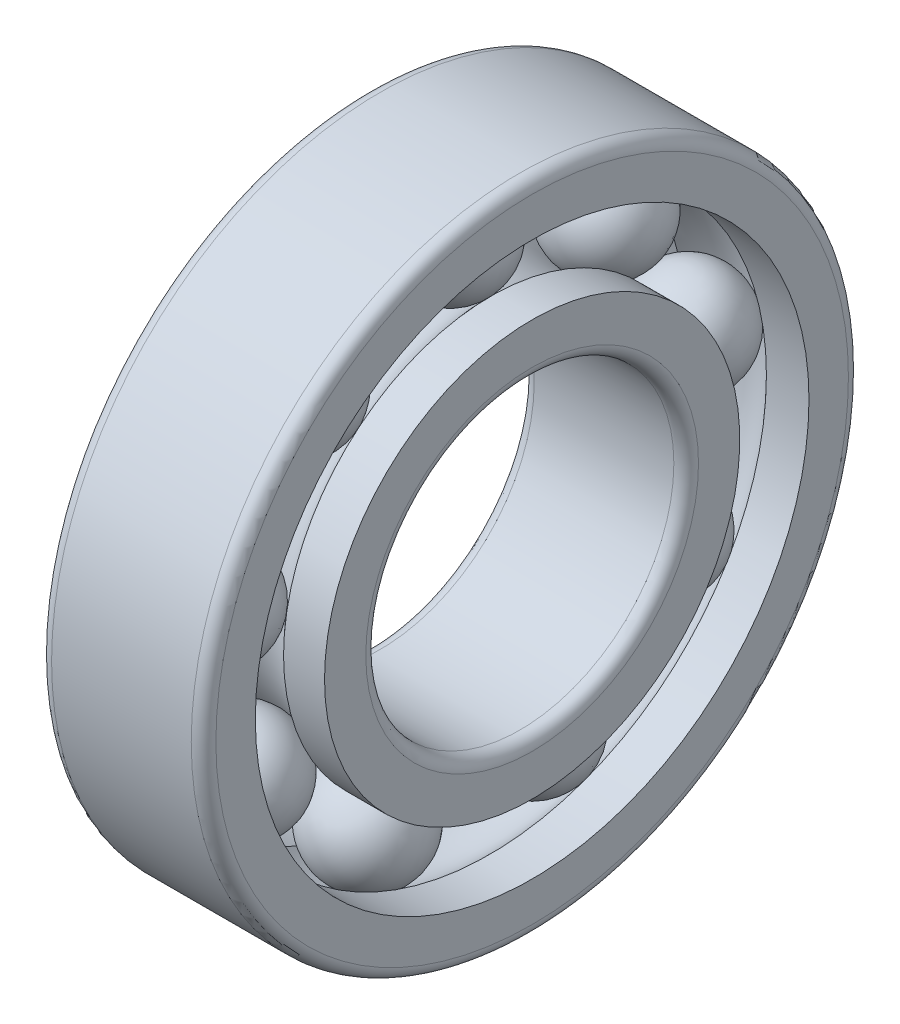
ISO-10303-21;
HEADER;
FILE_DESCRIPTION(('STEP AP214'),'2;1');
FILE_NAME('part.step','',(''),(''),'','','');
FILE_SCHEMA(('AUTOMOTIVE_DESIGN { 1 0 10303 214 1 1 1 1 }'));
ENDSEC;
DATA;
#1=APPLICATION_CONTEXT('core data for automotive mechanical design processes');
#2=APPLICATION_PROTOCOL_DEFINITION('international standard','automotive_design',2000,#1);
#3=PRODUCT_CONTEXT('',#1,'mechanical');
#4=PRODUCT('Part','Part','',(#3));
#5=PRODUCT_RELATED_PRODUCT_CATEGORY('part','',(#4));
#6=PRODUCT_DEFINITION_FORMATION('','',#4);
#7=PRODUCT_DEFINITION_CONTEXT('part definition',#1,'design');
#8=PRODUCT_DEFINITION('design','',#6,#7);
#9=PRODUCT_DEFINITION_SHAPE('','',#8);
#10=(LENGTH_UNIT() NAMED_UNIT(*) SI_UNIT(.MILLI.,.METRE.));
#11=(NAMED_UNIT(*) PLANE_ANGLE_UNIT() SI_UNIT($,.RADIAN.));
#12=(NAMED_UNIT(*) SI_UNIT($,.STERADIAN.) SOLID_ANGLE_UNIT());
#13=UNCERTAINTY_MEASURE_WITH_UNIT(LENGTH_MEASURE(1.E-05),#10,'distance_accuracy_value','');
#14=(GEOMETRIC_REPRESENTATION_CONTEXT(3) GLOBAL_UNCERTAINTY_ASSIGNED_CONTEXT((#13)) GLOBAL_UNIT_ASSIGNED_CONTEXT((#10,
#11,#12)) REPRESENTATION_CONTEXT('',''));
#15=CARTESIAN_POINT('',(0.,0.,0.));
#16=DIRECTION('',(0.,0.,1.));
#17=DIRECTION('',(1.,0.,0.));
#18=AXIS2_PLACEMENT_3D('',#15,#16,#17);
#19=CARTESIAN_POINT('',(8.54430501930505,-5.87874588152541,-11.5714910978934));
#20=DIRECTION('',(0.,0.984807753012215,0.173648177666941));
#21=DIRECTION('',(1.,0.,0.));
#22=AXIS2_PLACEMENT_3D('',#19,#20,#21);
#23=SPHERICAL_SURFACE('',#22,2.59);
#24=CARTESIAN_POINT('',(8.54430501930505,-3.32809380122378,-11.1217423177361));
#25=VERTEX_POINT('',#24);
#26=VERTEX_LOOP('',#25);
#27=FACE_BOUND('',#26,.T.);
#28=ADVANCED_FACE('P0_F13',(#27),#23,.T.);
#29=CLOSED_SHELL('',(#28));
#30=MANIFOLD_SOLID_BREP('P0_B1',#29);
#31=CARTESIAN_POINT('',(8.54430501930505,-18.9605002633465,4.01873668407662));
#32=DIRECTION('',(0.,-0.342020143325666,-0.939692620785918));
#33=DIRECTION('',(1.,0.,0.));
#34=AXIS2_PLACEMENT_3D('',#31,#32,#33);
#35=SPHERICAL_SURFACE('',#34,2.59);
#36=CARTESIAN_POINT('',(8.54430501930505,-19.84633243456,1.58493279624109));
#37=VERTEX_POINT('',#36);
#38=VERTEX_LOOP('',#37);
#39=FACE_BOUND('',#38,.T.);
#40=ADVANCED_FACE('P1_F13',(#39),#35,.T.);
#41=CLOSED_SHELL('',(#40));
#42=MANIFOLD_SOLID_BREP('P1_B1',#41);
#43=CARTESIAN_POINT('',(8.54430501930505,1.08191023753616,-7.55275441381672));
#44=DIRECTION('',(0.,0.642787609686536,0.766044443118992));
#45=DIRECTION('',(1.,0.,0.));
#46=AXIS2_PLACEMENT_3D('',#43,#44,#45);
#47=SPHERICAL_SURFACE('',#46,2.59);
#48=CARTESIAN_POINT('',(8.54430501930505,2.74673014662429,-5.56869930613853));
#49=VERTEX_POINT('',#48);
#50=VERTEX_LOOP('',#49);
#51=FACE_BOUND('',#50,.T.);
#52=ADVANCED_FACE('P2_F12',(#51),#47,.T.);
#53=CLOSED_SHELL('',(#52));
#54=MANIFOLD_SOLID_BREP('P2_B1',#53);
#55=CARTESIAN_POINT('',(8.54430501930505,1.08191023753606,7.55275441381695));
#56=DIRECTION('',(0.,-0.642787609686546,0.766044443118984));
#57=DIRECTION('',(1.,0.,0.));
#58=AXIS2_PLACEMENT_3D('',#55,#56,#57);
#59=SPHERICAL_SURFACE('',#58,2.59);
#60=CARTESIAN_POINT('',(8.54430501930505,-0.582909671552093,9.53680952149512));
#61=VERTEX_POINT('',#60);
#62=VERTEX_LOOP('',#61);
#63=FACE_BOUND('',#62,.T.);
#64=ADVANCED_FACE('P3_F13',(#63),#59,.T.);
#65=CLOSED_SHELL('',(#64));
#66=MANIFOLD_SOLID_BREP('P3_B1',#65);
#67=CARTESIAN_POINT('',(8.54430501930505,-13.7941119691119,-10.1757984944672));
#68=DIRECTION('',(0.,0.86602540378445,-0.499999999999997));
#69=DIRECTION('',(1.,0.,0.));
#70=AXIS2_PLACEMENT_3D('',#67,#68,#69);
#71=SPHERICAL_SURFACE('',#70,2.59);
#72=CARTESIAN_POINT('',(8.54430501930505,-11.5511061733102,-11.4707984944672));
#73=VERTEX_POINT('',#72);
#74=VERTEX_LOOP('',#73);
#75=FACE_BOUND('',#74,.T.);
#76=ADVANCED_FACE('P4_F13',(#75),#71,.T.);
#77=CLOSED_SHELL('',(#76));
#78=MANIFOLD_SOLID_BREP('P4_B1',#77);
#79=CARTESIAN_POINT('',(8.54430501930505,-13.7941119691121,10.1757984944672));
#80=DIRECTION('',(0.,-0.866025403784444,-0.500000000000008));
#81=DIRECTION('',(1.,0.,0.));
#82=AXIS2_PLACEMENT_3D('',#79,#80,#81);
#83=SPHERICAL_SURFACE('',#82,2.59);
#84=CARTESIAN_POINT('',(8.54430501930505,-16.0371177649138,8.88079849446723));
#85=VERTEX_POINT('',#84);
#86=VERTEX_LOOP('',#85);
#87=FACE_BOUND('',#86,.T.);
#88=ADVANCED_FACE('P5_F13',(#87),#83,.T.);
#89=CLOSED_SHELL('',(#88));
#90=MANIFOLD_SOLID_BREP('P5_B1',#89);
#91=CARTESIAN_POINT('',(8.54430501930505,3.83088803088809,0.));
#92=DIRECTION('',(0.,0.,1.00000000000001));
#93=DIRECTION('',(1.,0.,0.));
#94=AXIS2_PLACEMENT_3D('',#91,#92,#93);
#95=SPHERICAL_SURFACE('',#94,2.59);
#96=CARTESIAN_POINT('',(8.54430501930505,3.83088803088809,2.59000000000008));
#97=VERTEX_POINT('',#96);
#98=VERTEX_LOOP('',#97);
#99=FACE_BOUND('',#98,.T.);
#100=ADVANCED_FACE('P6_F13',(#99),#95,.T.);
#101=CLOSED_SHELL('',(#100));
#102=MANIFOLD_SOLID_BREP('P6_B1',#101);
#103=CARTESIAN_POINT('',(12.544305019305,5.56088803088802,0.));
#104=DIRECTION('',(-1.,0.,0.));
#105=DIRECTION('',(0.,0.,1.));
#106=AXIS2_PLACEMENT_3D('',#103,#104,#105);
#107=PLANE('',#106);
#108=CARTESIAN_POINT('',(12.544305019305,-7.91911196911198,0.));
#109=DIRECTION('',(-1.,0.,0.));
#110=DIRECTION('',(0.,0.,1.));
#111=AXIS2_PLACEMENT_3D('',#108,#109,#110);
#112=CIRCLE('',#111,15.4);
#113=CARTESIAN_POINT('',(12.544305019305,-7.91911196911198,15.4000000000001));
#114=VERTEX_POINT('',#113);
#115=EDGE_CURVE('P7_E43',#114,#114,#112,.T.);
#116=ORIENTED_EDGE('',*,*,#115,.F.);
#117=EDGE_LOOP('',(#116));
#118=FACE_BOUND('',#117,.T.);
#119=CARTESIAN_POINT('',(12.544305019305,-7.91911196911198,0.));
#120=DIRECTION('',(-1.,0.,0.));
#121=DIRECTION('',(0.,0.,1.));
#122=AXIS2_PLACEMENT_3D('',#119,#120,#121);
#123=CIRCLE('',#122,13.48);
#124=CARTESIAN_POINT('',(12.544305019305,-7.91911196911198,13.4800000000001));
#125=VERTEX_POINT('',#124);
#126=EDGE_CURVE('P7_E10',#125,#125,#123,.T.);
#127=ORIENTED_EDGE('',*,*,#126,.T.);
#128=EDGE_LOOP('',(#127));
#129=FACE_BOUND('',#128,.T.);
#130=ADVANCED_FACE('P7_F15',(#118,#129),#107,.F.);
#131=CARTESIAN_POINT('',(4.54430501930501,-7.91911196911198,0.));
#132=DIRECTION('',(-1.,0.,0.));
#133=DIRECTION('',(0.,0.,1.));
#134=AXIS2_PLACEMENT_3D('',#131,#132,#133);
#135=CYLINDRICAL_SURFACE('',#134,13.48);
#136=CARTESIAN_POINT('',(10.4717904278101,-7.91911196911198,0.));
#137=DIRECTION('',(-1.,0.,0.));
#138=DIRECTION('',(0.,0.,1.));
#139=AXIS2_PLACEMENT_3D('',#136,#137,#138);
#140=CIRCLE('',#139,13.48);
#141=CARTESIAN_POINT('',(10.4717904278101,-7.91911196911198,13.4800000000001));
#142=VERTEX_POINT('',#141);
#143=EDGE_CURVE('P7_E21',#142,#142,#140,.T.);
#144=ORIENTED_EDGE('',*,*,#143,.T.);
#145=EDGE_LOOP('',(#144));
#146=FACE_BOUND('',#145,.T.);
#147=ORIENTED_EDGE('',*,*,#126,.F.);
#148=EDGE_LOOP('',(#147));
#149=FACE_BOUND('',#148,.T.);
#150=ADVANCED_FACE('P7_F51',(#146,#149),#135,.F.);
#151=CARTESIAN_POINT('',(8.54430501930501,-7.91911196911198,0.));
#152=DIRECTION('',(-1.,0.,0.));
#153=DIRECTION('',(0.,0.,1.));
#154=AXIS2_PLACEMENT_3D('',#151,#152,#153);
#155=TOROIDAL_SURFACE('',#154,11.75,2.59);
#156=ORIENTED_EDGE('',*,*,#143,.F.);
#157=EDGE_LOOP('',(#156));
#158=FACE_BOUND('',#157,.T.);
#159=CARTESIAN_POINT('',(6.61681961079993,-7.91911196911198,0.));
#160=DIRECTION('',(-1.,0.,0.));
#161=DIRECTION('',(0.,0.,1.));
#162=AXIS2_PLACEMENT_3D('',#159,#160,#161);
#163=CIRCLE('',#162,13.48);
#164=CARTESIAN_POINT('',(6.61681961079993,-7.91911196911198,13.4800000000001));
#165=VERTEX_POINT('',#164);
#166=EDGE_CURVE('P7_E25',#165,#165,#163,.T.);
#167=ORIENTED_EDGE('',*,*,#166,.T.);
#168=EDGE_LOOP('',(#167));
#169=FACE_BOUND('',#168,.T.);
#170=ADVANCED_FACE('P7_F56',(#158,#169),#155,.F.);
#171=CARTESIAN_POINT('',(4.54430501930501,-7.91911196911198,0.));
#172=DIRECTION('',(-1.,0.,0.));
#173=DIRECTION('',(0.,0.,1.));
#174=AXIS2_PLACEMENT_3D('',#171,#172,#173);
#175=CYLINDRICAL_SURFACE('',#174,13.48);
#176=CARTESIAN_POINT('',(4.544305019305,-7.91911196911198,0.));
#177=DIRECTION('',(-1.,0.,0.));
#178=DIRECTION('',(0.,0.,1.));
#179=AXIS2_PLACEMENT_3D('',#176,#177,#178);
#180=CIRCLE('',#179,13.48);
#181=CARTESIAN_POINT('',(4.544305019305,-7.91911196911198,13.4800000000001));
#182=VERTEX_POINT('',#181);
#183=EDGE_CURVE('P7_E29',#182,#182,#180,.T.);
#184=ORIENTED_EDGE('',*,*,#183,.T.);
#185=EDGE_LOOP('',(#184));
#186=FACE_BOUND('',#185,.T.);
#187=ORIENTED_EDGE('',*,*,#166,.F.);
#188=EDGE_LOOP('',(#187));
#189=FACE_BOUND('',#188,.T.);
#190=ADVANCED_FACE('P7_F60',(#186,#189),#175,.F.);
#191=CARTESIAN_POINT('',(4.544305019305,7.48088803088802,0.));
#192=DIRECTION('',(1.,0.,0.));
#193=DIRECTION('',(0.,0.,-1.));
#194=AXIS2_PLACEMENT_3D('',#191,#192,#193);
#195=PLANE('',#194);
#196=ORIENTED_EDGE('',*,*,#183,.F.);
#197=EDGE_LOOP('',(#196));
#198=FACE_BOUND('',#197,.T.);
#199=CARTESIAN_POINT('',(4.544305019305,-7.91911196911198,0.));
#200=DIRECTION('',(-1.,0.,0.));
#201=DIRECTION('',(0.,0.,1.));
#202=AXIS2_PLACEMENT_3D('',#199,#200,#201);
#203=CIRCLE('',#202,15.4);
#204=CARTESIAN_POINT('',(4.544305019305,-7.91911196911198,15.4000000000001));
#205=VERTEX_POINT('',#204);
#206=EDGE_CURVE('P7_E34',#205,#205,#203,.T.);
#207=ORIENTED_EDGE('',*,*,#206,.T.);
#208=EDGE_LOOP('',(#207));
#209=FACE_BOUND('',#208,.T.);
#210=ADVANCED_FACE('P7_F67',(#198,#209),#195,.F.);
#211=CARTESIAN_POINT('',(5.14430501930501,-7.91911196911198,0.));
#212=DIRECTION('',(-1.,0.,0.));
#213=DIRECTION('',(0.,0.,1.));
#214=AXIS2_PLACEMENT_3D('',#211,#212,#213);
#215=TOROIDAL_SURFACE('',#214,15.4,0.6);
#216=CARTESIAN_POINT('',(5.14430501930501,-7.91911196911198,0.));
#217=DIRECTION('',(-1.,0.,0.));
#218=DIRECTION('',(0.,0.,1.));
#219=AXIS2_PLACEMENT_3D('',#216,#217,#218);
#220=CIRCLE('',#219,16.);
#221=CARTESIAN_POINT('',(5.14430501930501,-7.91911196911198,16.0000000000001));
#222=VERTEX_POINT('',#221);
#223=EDGE_CURVE('P7_E37',#222,#222,#220,.T.);
#224=ORIENTED_EDGE('',*,*,#223,.T.);
#225=EDGE_LOOP('',(#224));
#226=FACE_BOUND('',#225,.T.);
#227=ORIENTED_EDGE('',*,*,#206,.F.);
#228=EDGE_LOOP('',(#227));
#229=FACE_BOUND('',#228,.T.);
#230=ADVANCED_FACE('P7_F71',(#226,#229),#215,.T.);
#231=CARTESIAN_POINT('',(4.54430501930501,-7.91911196911198,0.));
#232=DIRECTION('',(-1.,0.,0.));
#233=DIRECTION('',(0.,0.,1.));
#234=AXIS2_PLACEMENT_3D('',#231,#232,#233);
#235=CYLINDRICAL_SURFACE('',#234,16.);
#236=CARTESIAN_POINT('',(11.944305019305,-7.91911196911198,0.));
#237=DIRECTION('',(-1.,0.,0.));
#238=DIRECTION('',(0.,0.,1.));
#239=AXIS2_PLACEMENT_3D('',#236,#237,#238);
#240=CIRCLE('',#239,16.);
#241=CARTESIAN_POINT('',(11.944305019305,-7.91911196911198,16.0000000000001));
#242=VERTEX_POINT('',#241);
#243=EDGE_CURVE('P7_E40',#242,#242,#240,.T.);
#244=ORIENTED_EDGE('',*,*,#243,.T.);
#245=EDGE_LOOP('',(#244));
#246=FACE_BOUND('',#245,.T.);
#247=ORIENTED_EDGE('',*,*,#223,.F.);
#248=EDGE_LOOP('',(#247));
#249=FACE_BOUND('',#248,.T.);
#250=ADVANCED_FACE('P7_F75',(#246,#249),#235,.T.);
#251=CARTESIAN_POINT('',(11.944305019305,-7.91911196911198,0.));
#252=DIRECTION('',(-1.,0.,0.));
#253=DIRECTION('',(0.,0.,1.));
#254=AXIS2_PLACEMENT_3D('',#251,#252,#253);
#255=TOROIDAL_SURFACE('',#254,15.4,0.6);
#256=ORIENTED_EDGE('',*,*,#115,.T.);
#257=EDGE_LOOP('',(#256));
#258=FACE_BOUND('',#257,.T.);
#259=ORIENTED_EDGE('',*,*,#243,.F.);
#260=EDGE_LOOP('',(#259));
#261=FACE_BOUND('',#260,.T.);
#262=ADVANCED_FACE('P7_F47',(#258,#261),#255,.T.);
#263=CLOSED_SHELL('',(#130,#150,#170,#190,#210,#230,#250,#262));
#264=MANIFOLD_SOLID_BREP('P7_B1',#263);
#265=CARTESIAN_POINT('',(8.54430501930505,-18.9605002633464,-4.01873668407666));
#266=DIRECTION('',(0.,0.342020143325678,-0.939692620785914));
#267=DIRECTION('',(1.,0.,0.));
#268=AXIS2_PLACEMENT_3D('',#265,#266,#267);
#269=SPHERICAL_SURFACE('',#268,2.59);
#270=CARTESIAN_POINT('',(8.54430501930505,-18.0746680921329,-6.45254057191218));
#271=VERTEX_POINT('',#270);
#272=VERTEX_LOOP('',#271);
#273=FACE_BOUND('',#272,.T.);
#274=ADVANCED_FACE('P8_F13',(#273),#269,.T.);
#275=CLOSED_SHELL('',(#274));
#276=MANIFOLD_SOLID_BREP('P8_B1',#275);
#277=CARTESIAN_POINT('',(4.544305019305,2.19088803088802,0.));
#278=DIRECTION('',(1.,0.,0.));
#279=DIRECTION('',(0.,0.,-1.));
#280=AXIS2_PLACEMENT_3D('',#277,#278,#279);
#281=PLANE('',#280);
#282=CARTESIAN_POINT('',(4.544305019305,-7.91911196911198,0.));
#283=DIRECTION('',(-1.,0.,0.));
#284=DIRECTION('',(0.,0.,1.));
#285=AXIS2_PLACEMENT_3D('',#282,#283,#284);
#286=CIRCLE('',#285,8.10000000000001);
#287=CARTESIAN_POINT('',(4.544305019305,-7.91911196911198,8.10000000000007));
#288=VERTEX_POINT('',#287);
#289=EDGE_CURVE('P9_E42',#288,#288,#286,.T.);
#290=ORIENTED_EDGE('',*,*,#289,.F.);
#291=EDGE_LOOP('',(#290));
#292=FACE_BOUND('',#291,.T.);
#293=CARTESIAN_POINT('',(4.544305019305,-7.91911196911198,0.));
#294=DIRECTION('',(-1.,0.,0.));
#295=DIRECTION('',(0.,0.,1.));
#296=AXIS2_PLACEMENT_3D('',#293,#294,#295);
#297=CIRCLE('',#296,10.11);
#298=CARTESIAN_POINT('',(4.544305019305,-7.91911196911198,10.1100000000001));
#299=VERTEX_POINT('',#298);
#300=EDGE_CURVE('P9_E9',#299,#299,#297,.T.);
#301=ORIENTED_EDGE('',*,*,#300,.T.);
#302=EDGE_LOOP('',(#301));
#303=FACE_BOUND('',#302,.T.);
#304=ADVANCED_FACE('P9_F14',(#292,#303),#281,.F.);
#305=CARTESIAN_POINT('',(4.544305019305,-7.91911196911198,0.));
#306=DIRECTION('',(-1.,0.,0.));
#307=DIRECTION('',(0.,0.,1.));
#308=AXIS2_PLACEMENT_3D('',#305,#306,#307);
#309=CYLINDRICAL_SURFACE('',#308,10.11);
#310=CARTESIAN_POINT('',(6.53968535463043,-7.91911196911198,0.));
#311=DIRECTION('',(-1.,0.,0.));
#312=DIRECTION('',(0.,0.,1.));
#313=AXIS2_PLACEMENT_3D('',#310,#311,#312);
#314=CIRCLE('',#313,10.11);
#315=CARTESIAN_POINT('',(6.53968535463043,-7.91911196911198,10.1100000000001));
#316=VERTEX_POINT('',#315);
#317=EDGE_CURVE('P9_E20',#316,#316,#314,.T.);
#318=ORIENTED_EDGE('',*,*,#317,.T.);
#319=EDGE_LOOP('',(#318));
#320=FACE_BOUND('',#319,.T.);
#321=ORIENTED_EDGE('',*,*,#300,.F.);
#322=EDGE_LOOP('',(#321));
#323=FACE_BOUND('',#322,.T.);
#324=ADVANCED_FACE('P9_F50',(#320,#323),#309,.T.);
#325=CARTESIAN_POINT('',(8.544305019305,-7.91911196911198,0.));
#326=DIRECTION('',(-1.,0.,0.));
#327=DIRECTION('',(0.,0.,1.));
#328=AXIS2_PLACEMENT_3D('',#325,#326,#327);
#329=TOROIDAL_SURFACE('',#328,11.75,2.59);
#330=CARTESIAN_POINT('',(10.5489246839796,-7.91911196911198,0.));
#331=DIRECTION('',(-1.,0.,0.));
#332=DIRECTION('',(0.,0.,1.));
#333=AXIS2_PLACEMENT_3D('',#330,#331,#332);
#334=CIRCLE('',#333,10.11);
#335=CARTESIAN_POINT('',(10.5489246839796,-7.91911196911198,10.1100000000001));
#336=VERTEX_POINT('',#335);
#337=EDGE_CURVE('P9_E24',#336,#336,#334,.T.);
#338=ORIENTED_EDGE('',*,*,#337,.T.);
#339=EDGE_LOOP('',(#338));
#340=FACE_BOUND('',#339,.T.);
#341=ORIENTED_EDGE('',*,*,#317,.F.);
#342=EDGE_LOOP('',(#341));
#343=FACE_BOUND('',#342,.T.);
#344=ADVANCED_FACE('P9_F55',(#340,#343),#329,.F.);
#345=CARTESIAN_POINT('',(4.544305019305,-7.91911196911198,0.));
#346=DIRECTION('',(-1.,0.,0.));
#347=DIRECTION('',(0.,0.,1.));
#348=AXIS2_PLACEMENT_3D('',#345,#346,#347);
#349=CYLINDRICAL_SURFACE('',#348,10.11);
#350=CARTESIAN_POINT('',(12.544305019305,-7.91911196911198,0.));
#351=DIRECTION('',(-1.,0.,0.));
#352=DIRECTION('',(0.,0.,1.));
#353=AXIS2_PLACEMENT_3D('',#350,#351,#352);
#354=CIRCLE('',#353,10.11);
#355=CARTESIAN_POINT('',(12.544305019305,-7.91911196911198,10.1100000000001));
#356=VERTEX_POINT('',#355);
#357=EDGE_CURVE('P9_E28',#356,#356,#354,.T.);
#358=ORIENTED_EDGE('',*,*,#357,.T.);
#359=EDGE_LOOP('',(#358));
#360=FACE_BOUND('',#359,.T.);
#361=ORIENTED_EDGE('',*,*,#337,.F.);
#362=EDGE_LOOP('',(#361));
#363=FACE_BOUND('',#362,.T.);
#364=ADVANCED_FACE('P9_F59',(#360,#363),#349,.T.);
#365=CARTESIAN_POINT('',(12.544305019305,0.180888030888029,0.));
#366=DIRECTION('',(-1.,0.,0.));
#367=DIRECTION('',(0.,0.,1.));
#368=AXIS2_PLACEMENT_3D('',#365,#366,#367);
#369=PLANE('',#368);
#370=ORIENTED_EDGE('',*,*,#357,.F.);
#371=EDGE_LOOP('',(#370));
#372=FACE_BOUND('',#371,.T.);
#373=CARTESIAN_POINT('',(12.544305019305,-7.91911196911198,0.));
#374=DIRECTION('',(-1.,0.,0.));
#375=DIRECTION('',(0.,0.,1.));
#376=AXIS2_PLACEMENT_3D('',#373,#374,#375);
#377=CIRCLE('',#376,8.10000000000001);
#378=CARTESIAN_POINT('',(12.544305019305,-7.91911196911198,8.10000000000006));
#379=VERTEX_POINT('',#378);
#380=EDGE_CURVE('P9_E33',#379,#379,#377,.T.);
#381=ORIENTED_EDGE('',*,*,#380,.T.);
#382=EDGE_LOOP('',(#381));
#383=FACE_BOUND('',#382,.T.);
#384=ADVANCED_FACE('P9_F66',(#372,#383),#369,.F.);
#385=CARTESIAN_POINT('',(11.944305019305,-7.91911196911198,0.));
#386=DIRECTION('',(-1.,0.,0.));
#387=DIRECTION('',(0.,0.,1.));
#388=AXIS2_PLACEMENT_3D('',#385,#386,#387);
#389=TOROIDAL_SURFACE('',#388,8.1,0.6);
#390=CARTESIAN_POINT('',(11.944305019305,-7.91911196911198,0.));
#391=DIRECTION('',(-1.,0.,0.));
#392=DIRECTION('',(0.,0.,1.));
#393=AXIS2_PLACEMENT_3D('',#390,#391,#392);
#394=CIRCLE('',#393,7.5);
#395=CARTESIAN_POINT('',(11.944305019305,-7.91911196911198,7.50000000000006));
#396=VERTEX_POINT('',#395);
#397=EDGE_CURVE('P9_E36',#396,#396,#394,.T.);
#398=ORIENTED_EDGE('',*,*,#397,.T.);
#399=EDGE_LOOP('',(#398));
#400=FACE_BOUND('',#399,.T.);
#401=ORIENTED_EDGE('',*,*,#380,.F.);
#402=EDGE_LOOP('',(#401));
#403=FACE_BOUND('',#402,.T.);
#404=ADVANCED_FACE('P9_F70',(#400,#403),#389,.T.);
#405=CARTESIAN_POINT('',(4.544305019305,-7.91911196911198,0.));
#406=DIRECTION('',(-1.,0.,0.));
#407=DIRECTION('',(0.,0.,1.));
#408=AXIS2_PLACEMENT_3D('',#405,#406,#407);
#409=CYLINDRICAL_SURFACE('',#408,7.5);
#410=CARTESIAN_POINT('',(5.14430501930501,-7.91911196911198,0.));
#411=DIRECTION('',(-1.,0.,0.));
#412=DIRECTION('',(0.,0.,1.));
#413=AXIS2_PLACEMENT_3D('',#410,#411,#412);
#414=CIRCLE('',#413,7.50000000000001);
#415=CARTESIAN_POINT('',(5.14430501930501,-7.91911196911198,7.50000000000006));
#416=VERTEX_POINT('',#415);
#417=EDGE_CURVE('P9_E39',#416,#416,#414,.T.);
#418=ORIENTED_EDGE('',*,*,#417,.T.);
#419=EDGE_LOOP('',(#418));
#420=FACE_BOUND('',#419,.T.);
#421=ORIENTED_EDGE('',*,*,#397,.F.);
#422=EDGE_LOOP('',(#421));
#423=FACE_BOUND('',#422,.T.);
#424=ADVANCED_FACE('P9_F74',(#420,#423),#409,.F.);
#425=CARTESIAN_POINT('',(5.14430501930501,-7.91911196911198,0.));
#426=DIRECTION('',(-1.,0.,0.));
#427=DIRECTION('',(0.,0.,1.));
#428=AXIS2_PLACEMENT_3D('',#425,#426,#427);
#429=TOROIDAL_SURFACE('',#428,8.10000000000001,0.6);
#430=ORIENTED_EDGE('',*,*,#289,.T.);
#431=EDGE_LOOP('',(#430));
#432=FACE_BOUND('',#431,.T.);
#433=ORIENTED_EDGE('',*,*,#417,.F.);
#434=EDGE_LOOP('',(#433));
#435=FACE_BOUND('',#434,.T.);
#436=ADVANCED_FACE('P9_F46',(#432,#435),#429,.T.);
#437=CLOSED_SHELL('',(#304,#324,#344,#364,#384,#404,#424,#436));
#438=MANIFOLD_SOLID_BREP('P9_B1',#437);
#439=CARTESIAN_POINT('',(8.54430501930505,-5.87874588152557,11.5714910978936));
#440=DIRECTION('',(0.,-0.984807753012217,0.173648177666929));
#441=DIRECTION('',(1.,0.,0.));
#442=AXIS2_PLACEMENT_3D('',#439,#440,#441);
#443=SPHERICAL_SURFACE('',#442,2.59);
#444=CARTESIAN_POINT('',(8.54430501930505,-8.42939796182721,12.0212398780509));
#445=VERTEX_POINT('',#444);
#446=VERTEX_LOOP('',#445);
#447=FACE_BOUND('',#446,.T.);
#448=ADVANCED_FACE('P10_F13',(#447),#443,.T.);
#449=CLOSED_SHELL('',(#448));
#450=MANIFOLD_SOLID_BREP('P10_B1',#449);
#451=ADVANCED_BREP_SHAPE_REPRESENTATION('',(#18,#30,#42,#54,#66,#78,#90,#102,#264,#276,#438,
#450),#14);
#452=SHAPE_DEFINITION_REPRESENTATION(#9,#451);
ENDSEC;
END-ISO-10303-21;
